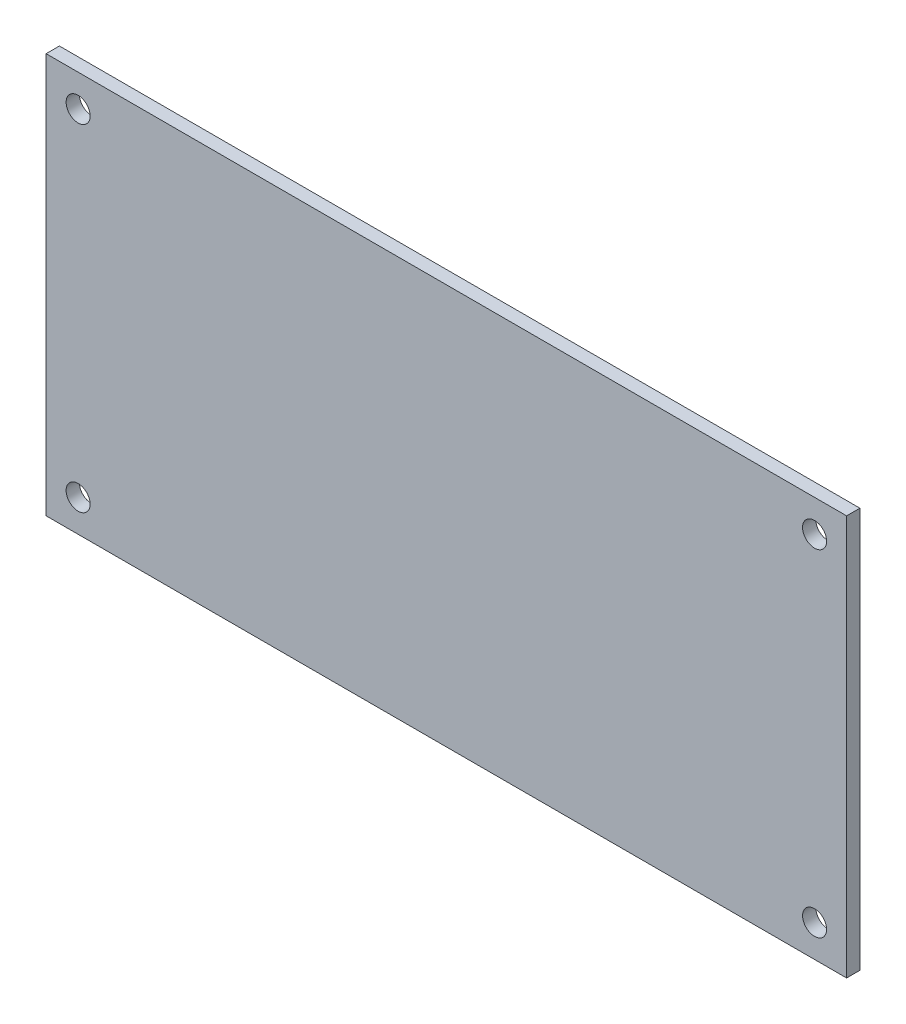
ISO-10303-21;
HEADER;
FILE_DESCRIPTION(('STEP AP214'),'2;1');
FILE_NAME('part.step','',(''),(''),'','','');
FILE_SCHEMA(('AUTOMOTIVE_DESIGN { 1 0 10303 214 1 1 1 1 }'));
ENDSEC;
DATA;
#1=APPLICATION_CONTEXT('core data for automotive mechanical design processes');
#2=APPLICATION_PROTOCOL_DEFINITION('international standard','automotive_design',2000,#1);
#3=PRODUCT_CONTEXT('',#1,'mechanical');
#4=PRODUCT('Part','Part','',(#3));
#5=PRODUCT_RELATED_PRODUCT_CATEGORY('part','',(#4));
#6=PRODUCT_DEFINITION_FORMATION('','',#4);
#7=PRODUCT_DEFINITION_CONTEXT('part definition',#1,'design');
#8=PRODUCT_DEFINITION('design','',#6,#7);
#9=PRODUCT_DEFINITION_SHAPE('','',#8);
#10=(LENGTH_UNIT() NAMED_UNIT(*) SI_UNIT(.MILLI.,.METRE.));
#11=(NAMED_UNIT(*) PLANE_ANGLE_UNIT() SI_UNIT($,.RADIAN.));
#12=(NAMED_UNIT(*) SI_UNIT($,.STERADIAN.) SOLID_ANGLE_UNIT());
#13=UNCERTAINTY_MEASURE_WITH_UNIT(LENGTH_MEASURE(1.E-05),#10,'distance_accuracy_value','');
#14=(GEOMETRIC_REPRESENTATION_CONTEXT(3) GLOBAL_UNCERTAINTY_ASSIGNED_CONTEXT((#13)) GLOBAL_UNIT_ASSIGNED_CONTEXT((#10,
#11,#12)) REPRESENTATION_CONTEXT('',''));
#15=CARTESIAN_POINT('',(0.,0.,0.));
#16=DIRECTION('',(0.,0.,1.));
#17=DIRECTION('',(1.,0.,0.));
#18=AXIS2_PLACEMENT_3D('',#15,#16,#17);
#19=CARTESIAN_POINT('',(0.,0.,1.66));
#20=DIRECTION('',(0.,0.,-1.));
#21=DIRECTION('',(-1.,0.,0.));
#22=AXIS2_PLACEMENT_3D('',#19,#20,#21);
#23=PLANE('',#22);
#24=DIRECTION('',(0.,-1.,0.));
#25=VECTOR('',#24,1.);
#26=CARTESIAN_POINT('',(-50.,25.,1.66));
#27=LINE('',#26,#25);
#28=CARTESIAN_POINT('',(-50.,25.,1.66));
#29=VERTEX_POINT('',#28);
#30=CARTESIAN_POINT('',(-50.,-25.,1.66));
#31=VERTEX_POINT('',#30);
#32=EDGE_CURVE('E85',#29,#31,#27,.T.);
#33=ORIENTED_EDGE('',*,*,#32,.T.);
#34=DIRECTION('',(1.,0.,0.));
#35=VECTOR('',#34,1.);
#36=CARTESIAN_POINT('',(50.,-25.,1.66));
#37=LINE('',#36,#35);
#38=CARTESIAN_POINT('',(50.,-25.,1.66));
#39=VERTEX_POINT('',#38);
#40=EDGE_CURVE('E80',#31,#39,#37,.T.);
#41=ORIENTED_EDGE('',*,*,#40,.T.);
#42=DIRECTION('',(0.,1.,0.));
#43=VECTOR('',#42,1.);
#44=CARTESIAN_POINT('',(50.,25.,1.66));
#45=LINE('',#44,#43);
#46=CARTESIAN_POINT('',(50.,25.,1.66));
#47=VERTEX_POINT('',#46);
#48=EDGE_CURVE('E83',#39,#47,#45,.T.);
#49=ORIENTED_EDGE('',*,*,#48,.T.);
#50=DIRECTION('',(-1.,0.,0.));
#51=VECTOR('',#50,1.);
#52=CARTESIAN_POINT('',(50.,25.,1.66));
#53=LINE('',#52,#51);
#54=EDGE_CURVE('E50',#47,#29,#53,.T.);
#55=ORIENTED_EDGE('',*,*,#54,.T.);
#56=EDGE_LOOP('',(#33,#41,#49,#55));
#57=FACE_BOUND('',#56,.T.);
#58=CARTESIAN_POINT('',(-46.,21.,1.66));
#59=DIRECTION('',(0.,0.,1.));
#60=DIRECTION('',(1.,0.,0.));
#61=AXIS2_PLACEMENT_3D('',#58,#59,#60);
#62=CIRCLE('',#61,1.5);
#63=CARTESIAN_POINT('',(-44.5,21.,1.66));
#64=VERTEX_POINT('',#63);
#65=EDGE_CURVE('E100',#64,#64,#62,.T.);
#66=ORIENTED_EDGE('',*,*,#65,.F.);
#67=EDGE_LOOP('',(#66));
#68=FACE_BOUND('',#67,.T.);
#69=CARTESIAN_POINT('',(-46.,-21.,1.66));
#70=DIRECTION('',(0.,0.,1.));
#71=DIRECTION('',(1.,0.,0.));
#72=AXIS2_PLACEMENT_3D('',#69,#70,#71);
#73=CIRCLE('',#72,1.5);
#74=CARTESIAN_POINT('',(-44.5,-21.,1.66));
#75=VERTEX_POINT('',#74);
#76=EDGE_CURVE('E115',#75,#75,#73,.T.);
#77=ORIENTED_EDGE('',*,*,#76,.F.);
#78=EDGE_LOOP('',(#77));
#79=FACE_BOUND('',#78,.T.);
#80=CARTESIAN_POINT('',(46.,21.,1.66));
#81=DIRECTION('',(0.,0.,1.));
#82=DIRECTION('',(1.,0.,0.));
#83=AXIS2_PLACEMENT_3D('',#80,#81,#82);
#84=CIRCLE('',#83,1.5);
#85=CARTESIAN_POINT('',(47.5,21.,1.66));
#86=VERTEX_POINT('',#85);
#87=EDGE_CURVE('E121',#86,#86,#84,.T.);
#88=ORIENTED_EDGE('',*,*,#87,.F.);
#89=EDGE_LOOP('',(#88));
#90=FACE_BOUND('',#89,.T.);
#91=CARTESIAN_POINT('',(46.,-21.,1.66));
#92=DIRECTION('',(0.,0.,1.));
#93=DIRECTION('',(1.,0.,0.));
#94=AXIS2_PLACEMENT_3D('',#91,#92,#93);
#95=CIRCLE('',#94,1.5);
#96=CARTESIAN_POINT('',(47.5,-21.,1.66));
#97=VERTEX_POINT('',#96);
#98=EDGE_CURVE('E127',#97,#97,#95,.T.);
#99=ORIENTED_EDGE('',*,*,#98,.F.);
#100=EDGE_LOOP('',(#99));
#101=FACE_BOUND('',#100,.T.);
#102=ADVANCED_FACE('F33',(#57,#68,#79,#90,#101),#23,.F.);
#103=CARTESIAN_POINT('',(0.,0.,0.));
#104=DIRECTION('',(0.,0.,-1.));
#105=DIRECTION('',(-1.,0.,0.));
#106=AXIS2_PLACEMENT_3D('',#103,#104,#105);
#107=PLANE('',#106);
#108=CARTESIAN_POINT('',(46.,21.,0.));
#109=DIRECTION('',(0.,0.,1.));
#110=DIRECTION('',(1.,0.,0.));
#111=AXIS2_PLACEMENT_3D('',#108,#109,#110);
#112=CIRCLE('',#111,1.5);
#113=CARTESIAN_POINT('',(47.5,21.,0.));
#114=VERTEX_POINT('',#113);
#115=EDGE_CURVE('E124',#114,#114,#112,.T.);
#116=ORIENTED_EDGE('',*,*,#115,.T.);
#117=EDGE_LOOP('',(#116));
#118=FACE_BOUND('',#117,.T.);
#119=CARTESIAN_POINT('',(-46.,21.,0.));
#120=DIRECTION('',(0.,0.,1.));
#121=DIRECTION('',(1.,0.,0.));
#122=AXIS2_PLACEMENT_3D('',#119,#120,#121);
#123=CIRCLE('',#122,1.5);
#124=CARTESIAN_POINT('',(-44.5,21.,0.));
#125=VERTEX_POINT('',#124);
#126=EDGE_CURVE('E112',#125,#125,#123,.T.);
#127=ORIENTED_EDGE('',*,*,#126,.T.);
#128=EDGE_LOOP('',(#127));
#129=FACE_BOUND('',#128,.T.);
#130=DIRECTION('',(0.,-1.,0.));
#131=VECTOR('',#130,1.);
#132=CARTESIAN_POINT('',(-50.,25.,0.));
#133=LINE('',#132,#131);
#134=CARTESIAN_POINT('',(-50.,25.,0.));
#135=VERTEX_POINT('',#134);
#136=CARTESIAN_POINT('',(-50.,-25.,0.));
#137=VERTEX_POINT('',#136);
#138=EDGE_CURVE('E97',#135,#137,#133,.T.);
#139=ORIENTED_EDGE('',*,*,#138,.F.);
#140=DIRECTION('',(-1.,0.,0.));
#141=VECTOR('',#140,1.);
#142=CARTESIAN_POINT('',(50.,25.,0.));
#143=LINE('',#142,#141);
#144=CARTESIAN_POINT('',(50.,25.,0.));
#145=VERTEX_POINT('',#144);
#146=EDGE_CURVE('E73',#145,#135,#143,.T.);
#147=ORIENTED_EDGE('',*,*,#146,.F.);
#148=DIRECTION('',(0.,1.,0.));
#149=VECTOR('',#148,1.);
#150=CARTESIAN_POINT('',(50.,25.,0.));
#151=LINE('',#150,#149);
#152=CARTESIAN_POINT('',(50.,-25.,0.));
#153=VERTEX_POINT('',#152);
#154=EDGE_CURVE('E67',#153,#145,#151,.T.);
#155=ORIENTED_EDGE('',*,*,#154,.F.);
#156=DIRECTION('',(1.,0.,0.));
#157=VECTOR('',#156,1.);
#158=CARTESIAN_POINT('',(50.,-25.,0.));
#159=LINE('',#158,#157);
#160=EDGE_CURVE('E89',#137,#153,#159,.T.);
#161=ORIENTED_EDGE('',*,*,#160,.F.);
#162=EDGE_LOOP('',(#139,#147,#155,#161));
#163=FACE_BOUND('',#162,.T.);
#164=CARTESIAN_POINT('',(-46.,-21.,0.));
#165=DIRECTION('',(0.,0.,1.));
#166=DIRECTION('',(1.,0.,0.));
#167=AXIS2_PLACEMENT_3D('',#164,#165,#166);
#168=CIRCLE('',#167,1.5);
#169=CARTESIAN_POINT('',(-44.5,-21.,0.));
#170=VERTEX_POINT('',#169);
#171=EDGE_CURVE('E118',#170,#170,#168,.T.);
#172=ORIENTED_EDGE('',*,*,#171,.T.);
#173=EDGE_LOOP('',(#172));
#174=FACE_BOUND('',#173,.T.);
#175=CARTESIAN_POINT('',(46.,-21.,0.));
#176=DIRECTION('',(0.,0.,1.));
#177=DIRECTION('',(1.,0.,0.));
#178=AXIS2_PLACEMENT_3D('',#175,#176,#177);
#179=CIRCLE('',#178,1.5);
#180=CARTESIAN_POINT('',(47.5,-21.,0.));
#181=VERTEX_POINT('',#180);
#182=EDGE_CURVE('E130',#181,#181,#179,.T.);
#183=ORIENTED_EDGE('',*,*,#182,.T.);
#184=EDGE_LOOP('',(#183));
#185=FACE_BOUND('',#184,.T.);
#186=ADVANCED_FACE('F108',(#118,#129,#163,#174,#185),#107,.T.);
#187=CARTESIAN_POINT('',(-50.,25.,1.66));
#188=DIRECTION('',(1.,0.,0.));
#189=DIRECTION('',(0.,0.,-1.));
#190=AXIS2_PLACEMENT_3D('',#187,#188,#189);
#191=PLANE('',#190);
#192=ORIENTED_EDGE('',*,*,#138,.T.);
#193=DIRECTION('',(0.,0.,-1.));
#194=VECTOR('',#193,1.);
#195=CARTESIAN_POINT('',(-50.,-25.,1.66));
#196=LINE('',#195,#194);
#197=EDGE_CURVE('E11',#31,#137,#196,.T.);
#198=ORIENTED_EDGE('',*,*,#197,.F.);
#199=ORIENTED_EDGE('',*,*,#32,.F.);
#200=DIRECTION('',(0.,0.,-1.));
#201=VECTOR('',#200,1.);
#202=CARTESIAN_POINT('',(-50.,25.,1.66));
#203=LINE('',#202,#201);
#204=EDGE_CURVE('E93',#29,#135,#203,.T.);
#205=ORIENTED_EDGE('',*,*,#204,.T.);
#206=EDGE_LOOP('',(#192,#198,#199,#205));
#207=FACE_BOUND('',#206,.T.);
#208=ADVANCED_FACE('F35',(#207),#191,.F.);
#209=CARTESIAN_POINT('',(50.,-25.,1.66));
#210=DIRECTION('',(0.,1.,0.));
#211=DIRECTION('',(-1.,0.,0.));
#212=AXIS2_PLACEMENT_3D('',#209,#210,#211);
#213=PLANE('',#212);
#214=ORIENTED_EDGE('',*,*,#160,.T.);
#215=DIRECTION('',(0.,0.,-1.));
#216=VECTOR('',#215,1.);
#217=CARTESIAN_POINT('',(50.,-25.,1.66));
#218=LINE('',#217,#216);
#219=EDGE_CURVE('E42',#39,#153,#218,.T.);
#220=ORIENTED_EDGE('',*,*,#219,.F.);
#221=ORIENTED_EDGE('',*,*,#40,.F.);
#222=ORIENTED_EDGE('',*,*,#197,.T.);
#223=EDGE_LOOP('',(#214,#220,#221,#222));
#224=FACE_BOUND('',#223,.T.);
#225=ADVANCED_FACE('F88',(#224),#213,.F.);
#226=CARTESIAN_POINT('',(50.,25.,1.66));
#227=DIRECTION('',(-1.,0.,0.));
#228=DIRECTION('',(0.,0.,1.));
#229=AXIS2_PLACEMENT_3D('',#226,#227,#228);
#230=PLANE('',#229);
#231=ORIENTED_EDGE('',*,*,#154,.T.);
#232=DIRECTION('',(0.,0.,-1.));
#233=VECTOR('',#232,1.);
#234=CARTESIAN_POINT('',(50.,25.,1.66));
#235=LINE('',#234,#233);
#236=EDGE_CURVE('E90',#47,#145,#235,.T.);
#237=ORIENTED_EDGE('',*,*,#236,.F.);
#238=ORIENTED_EDGE('',*,*,#48,.F.);
#239=ORIENTED_EDGE('',*,*,#219,.T.);
#240=EDGE_LOOP('',(#231,#237,#238,#239));
#241=FACE_BOUND('',#240,.T.);
#242=ADVANCED_FACE('F91',(#241),#230,.F.);
#243=CARTESIAN_POINT('',(50.,25.,1.66));
#244=DIRECTION('',(0.,-1.,0.));
#245=DIRECTION('',(1.,0.,0.));
#246=AXIS2_PLACEMENT_3D('',#243,#244,#245);
#247=PLANE('',#246);
#248=ORIENTED_EDGE('',*,*,#146,.T.);
#249=ORIENTED_EDGE('',*,*,#204,.F.);
#250=ORIENTED_EDGE('',*,*,#54,.F.);
#251=ORIENTED_EDGE('',*,*,#236,.T.);
#252=EDGE_LOOP('',(#248,#249,#250,#251));
#253=FACE_BOUND('',#252,.T.);
#254=ADVANCED_FACE('F105',(#253),#247,.F.);
#255=CARTESIAN_POINT('',(-46.,21.,1.66));
#256=DIRECTION('',(0.,0.,-1.));
#257=DIRECTION('',(-1.,0.,0.));
#258=AXIS2_PLACEMENT_3D('',#255,#256,#257);
#259=CYLINDRICAL_SURFACE('',#258,1.5);
#260=ORIENTED_EDGE('',*,*,#65,.T.);
#261=EDGE_LOOP('',(#260));
#262=FACE_BOUND('',#261,.T.);
#263=ORIENTED_EDGE('',*,*,#126,.F.);
#264=EDGE_LOOP('',(#263));
#265=FACE_BOUND('',#264,.T.);
#266=ADVANCED_FACE('F147',(#262,#265),#259,.F.);
#267=CARTESIAN_POINT('',(-46.,-21.,1.66));
#268=DIRECTION('',(0.,0.,-1.));
#269=DIRECTION('',(-1.,0.,0.));
#270=AXIS2_PLACEMENT_3D('',#267,#268,#269);
#271=CYLINDRICAL_SURFACE('',#270,1.5);
#272=ORIENTED_EDGE('',*,*,#76,.T.);
#273=EDGE_LOOP('',(#272));
#274=FACE_BOUND('',#273,.T.);
#275=ORIENTED_EDGE('',*,*,#171,.F.);
#276=EDGE_LOOP('',(#275));
#277=FACE_BOUND('',#276,.T.);
#278=ADVANCED_FACE('F193',(#274,#277),#271,.F.);
#279=CARTESIAN_POINT('',(46.,21.,1.66));
#280=DIRECTION('',(0.,0.,-1.));
#281=DIRECTION('',(-1.,0.,0.));
#282=AXIS2_PLACEMENT_3D('',#279,#280,#281);
#283=CYLINDRICAL_SURFACE('',#282,1.5);
#284=ORIENTED_EDGE('',*,*,#87,.T.);
#285=EDGE_LOOP('',(#284));
#286=FACE_BOUND('',#285,.T.);
#287=ORIENTED_EDGE('',*,*,#115,.F.);
#288=EDGE_LOOP('',(#287));
#289=FACE_BOUND('',#288,.T.);
#290=ADVANCED_FACE('F201',(#286,#289),#283,.F.);
#291=CARTESIAN_POINT('',(46.,-21.,1.66));
#292=DIRECTION('',(0.,0.,-1.));
#293=DIRECTION('',(-1.,0.,0.));
#294=AXIS2_PLACEMENT_3D('',#291,#292,#293);
#295=CYLINDRICAL_SURFACE('',#294,1.5);
#296=ORIENTED_EDGE('',*,*,#98,.T.);
#297=EDGE_LOOP('',(#296));
#298=FACE_BOUND('',#297,.T.);
#299=ORIENTED_EDGE('',*,*,#182,.F.);
#300=EDGE_LOOP('',(#299));
#301=FACE_BOUND('',#300,.T.);
#302=ADVANCED_FACE('F136',(#298,#301),#295,.F.);
#303=CLOSED_SHELL('',(#102,#186,#208,#225,#242,#254,#266,#278,#290,#302));
#304=MANIFOLD_SOLID_BREP('B2',#303);
#305=ADVANCED_BREP_SHAPE_REPRESENTATION('',(#18,#304),#14);
#306=SHAPE_DEFINITION_REPRESENTATION(#9,#305);
ENDSEC;
END-ISO-10303-21;
